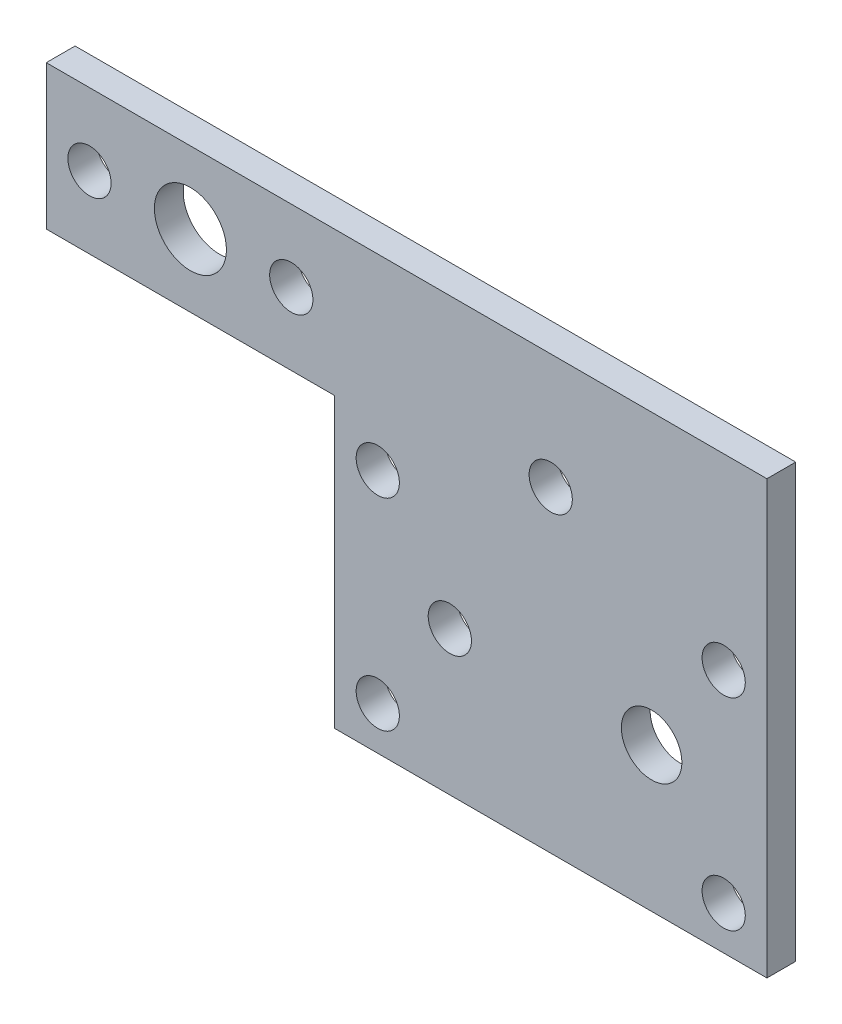
ISO-10303-21;
HEADER;
FILE_DESCRIPTION(('STEP AP214'),'2;1');
FILE_NAME('part.step','',(''),(''),'','','');
FILE_SCHEMA(('AUTOMOTIVE_DESIGN { 1 0 10303 214 1 1 1 1 }'));
ENDSEC;
DATA;
#1=APPLICATION_CONTEXT('core data for automotive mechanical design processes');
#2=APPLICATION_PROTOCOL_DEFINITION('international standard','automotive_design',2000,#1);
#3=PRODUCT_CONTEXT('',#1,'mechanical');
#4=PRODUCT('Part','Part','',(#3));
#5=PRODUCT_RELATED_PRODUCT_CATEGORY('part','',(#4));
#6=PRODUCT_DEFINITION_FORMATION('','',#4);
#7=PRODUCT_DEFINITION_CONTEXT('part definition',#1,'design');
#8=PRODUCT_DEFINITION('design','',#6,#7);
#9=PRODUCT_DEFINITION_SHAPE('','',#8);
#10=(LENGTH_UNIT() NAMED_UNIT(*) SI_UNIT(.MILLI.,.METRE.));
#11=(NAMED_UNIT(*) PLANE_ANGLE_UNIT() SI_UNIT($,.RADIAN.));
#12=(NAMED_UNIT(*) SI_UNIT($,.STERADIAN.) SOLID_ANGLE_UNIT());
#13=UNCERTAINTY_MEASURE_WITH_UNIT(LENGTH_MEASURE(1.E-05),#10,'distance_accuracy_value','');
#14=(GEOMETRIC_REPRESENTATION_CONTEXT(3) GLOBAL_UNCERTAINTY_ASSIGNED_CONTEXT((#13)) GLOBAL_UNIT_ASSIGNED_CONTEXT((#10,
#11,#12)) REPRESENTATION_CONTEXT('',''));
#15=CARTESIAN_POINT('',(0.,0.,0.));
#16=DIRECTION('',(0.,0.,1.));
#17=DIRECTION('',(1.,0.,0.));
#18=AXIS2_PLACEMENT_3D('',#15,#16,#17);
#19=CARTESIAN_POINT('',(0.,0.,2.));
#20=DIRECTION('',(0.,0.,-1.));
#21=DIRECTION('',(-1.,0.,0.));
#22=AXIS2_PLACEMENT_3D('',#19,#20,#21);
#23=PLANE('',#22);
#24=CARTESIAN_POINT('',(42.,10.,2.));
#25=DIRECTION('',(0.,0.,1.));
#26=DIRECTION('',(1.,0.,0.));
#27=AXIS2_PLACEMENT_3D('',#24,#25,#26);
#28=CIRCLE('',#27,2.1);
#29=CARTESIAN_POINT('',(44.1,10.,2.));
#30=VERTEX_POINT('',#29);
#31=EDGE_CURVE('E226',#30,#30,#28,.T.);
#32=ORIENTED_EDGE('',*,*,#31,.F.);
#33=EDGE_LOOP('',(#32));
#34=FACE_BOUND('',#33,.T.);
#35=CARTESIAN_POINT('',(28.,10.,2.));
#36=DIRECTION('',(0.,0.,1.));
#37=DIRECTION('',(1.,0.,0.));
#38=AXIS2_PLACEMENT_3D('',#35,#36,#37);
#39=CIRCLE('',#38,1.5);
#40=CARTESIAN_POINT('',(29.5,10.,2.));
#41=VERTEX_POINT('',#40);
#42=EDGE_CURVE('E238',#41,#41,#39,.T.);
#43=ORIENTED_EDGE('',*,*,#42,.F.);
#44=EDGE_LOOP('',(#43));
#45=FACE_BOUND('',#44,.T.);
#46=CARTESIAN_POINT('',(3.,25.,2.));
#47=DIRECTION('',(0.,0.,1.));
#48=DIRECTION('',(1.,0.,0.));
#49=AXIS2_PLACEMENT_3D('',#46,#47,#48);
#50=CIRCLE('',#49,1.5);
#51=CARTESIAN_POINT('',(4.5,25.,2.));
#52=VERTEX_POINT('',#51);
#53=EDGE_CURVE('E250',#52,#52,#50,.T.);
#54=ORIENTED_EDGE('',*,*,#53,.F.);
#55=EDGE_LOOP('',(#54));
#56=FACE_BOUND('',#55,.T.);
#57=CARTESIAN_POINT('',(47.,3.,2.));
#58=DIRECTION('',(0.,0.,1.));
#59=DIRECTION('',(1.,0.,0.));
#60=AXIS2_PLACEMENT_3D('',#57,#58,#59);
#61=CIRCLE('',#60,1.5);
#62=CARTESIAN_POINT('',(48.5,3.,2.));
#63=VERTEX_POINT('',#62);
#64=EDGE_CURVE('E262',#63,#63,#61,.T.);
#65=ORIENTED_EDGE('',*,*,#64,.F.);
#66=EDGE_LOOP('',(#65));
#67=FACE_BOUND('',#66,.T.);
#68=CARTESIAN_POINT('',(23.,17.,2.));
#69=DIRECTION('',(0.,0.,1.));
#70=DIRECTION('',(1.,0.,0.));
#71=AXIS2_PLACEMENT_3D('',#68,#69,#70);
#72=CIRCLE('',#71,1.5);
#73=CARTESIAN_POINT('',(24.5,17.,2.));
#74=VERTEX_POINT('',#73);
#75=EDGE_CURVE('E134',#74,#74,#72,.T.);
#76=ORIENTED_EDGE('',*,*,#75,.F.);
#77=EDGE_LOOP('',(#76));
#78=FACE_BOUND('',#77,.T.);
#79=DIRECTION('',(0.,1.,0.));
#80=VECTOR('',#79,1.);
#81=CARTESIAN_POINT('',(50.,0.,2.));
#82=LINE('',#81,#80);
#83=CARTESIAN_POINT('',(50.,0.,2.));
#84=VERTEX_POINT('',#83);
#85=CARTESIAN_POINT('',(50.,30.,2.));
#86=VERTEX_POINT('',#85);
#87=EDGE_CURVE('E141',#84,#86,#82,.T.);
#88=ORIENTED_EDGE('',*,*,#87,.T.);
#89=DIRECTION('',(-1.,0.,0.));
#90=VECTOR('',#89,1.);
#91=CARTESIAN_POINT('',(0.,30.,2.));
#92=LINE('',#91,#90);
#93=CARTESIAN_POINT('',(0.,30.,2.));
#94=VERTEX_POINT('',#93);
#95=EDGE_CURVE('E99',#86,#94,#92,.T.);
#96=ORIENTED_EDGE('',*,*,#95,.T.);
#97=DIRECTION('',(0.,-1.,0.));
#98=VECTOR('',#97,1.);
#99=CARTESIAN_POINT('',(0.,20.,2.));
#100=LINE('',#99,#98);
#101=CARTESIAN_POINT('',(0.,20.,2.));
#102=VERTEX_POINT('',#101);
#103=EDGE_CURVE('E112',#94,#102,#100,.T.);
#104=ORIENTED_EDGE('',*,*,#103,.T.);
#105=DIRECTION('',(1.,0.,0.));
#106=VECTOR('',#105,1.);
#107=CARTESIAN_POINT('',(0.,20.,2.));
#108=LINE('',#107,#106);
#109=CARTESIAN_POINT('',(20.,20.,2.));
#110=VERTEX_POINT('',#109);
#111=EDGE_CURVE('E106',#102,#110,#108,.T.);
#112=ORIENTED_EDGE('',*,*,#111,.T.);
#113=DIRECTION('',(0.,-1.,0.));
#114=VECTOR('',#113,1.);
#115=CARTESIAN_POINT('',(20.,0.,2.));
#116=LINE('',#115,#114);
#117=CARTESIAN_POINT('',(20.,0.,2.));
#118=VERTEX_POINT('',#117);
#119=EDGE_CURVE('E110',#110,#118,#116,.T.);
#120=ORIENTED_EDGE('',*,*,#119,.T.);
#121=DIRECTION('',(1.,0.,0.));
#122=VECTOR('',#121,1.);
#123=CARTESIAN_POINT('',(20.,0.,2.));
#124=LINE('',#123,#122);
#125=EDGE_CURVE('E62',#118,#84,#124,.T.);
#126=ORIENTED_EDGE('',*,*,#125,.T.);
#127=EDGE_LOOP('',(#88,#96,#104,#112,#120,#126));
#128=FACE_BOUND('',#127,.T.);
#129=CARTESIAN_POINT('',(23.,3.,2.));
#130=DIRECTION('',(0.,0.,1.));
#131=DIRECTION('',(1.,0.,0.));
#132=AXIS2_PLACEMENT_3D('',#129,#130,#131);
#133=CIRCLE('',#132,1.5);
#134=CARTESIAN_POINT('',(24.5,3.,2.));
#135=VERTEX_POINT('',#134);
#136=EDGE_CURVE('E268',#135,#135,#133,.T.);
#137=ORIENTED_EDGE('',*,*,#136,.F.);
#138=EDGE_LOOP('',(#137));
#139=FACE_BOUND('',#138,.T.);
#140=CARTESIAN_POINT('',(47.,17.,2.));
#141=DIRECTION('',(0.,0.,1.));
#142=DIRECTION('',(1.,0.,0.));
#143=AXIS2_PLACEMENT_3D('',#140,#141,#142);
#144=CIRCLE('',#143,1.5);
#145=CARTESIAN_POINT('',(48.5,17.,2.));
#146=VERTEX_POINT('',#145);
#147=EDGE_CURVE('E256',#146,#146,#144,.T.);
#148=ORIENTED_EDGE('',*,*,#147,.F.);
#149=EDGE_LOOP('',(#148));
#150=FACE_BOUND('',#149,.T.);
#151=CARTESIAN_POINT('',(17.,25.,2.));
#152=DIRECTION('',(0.,0.,1.));
#153=DIRECTION('',(1.,0.,0.));
#154=AXIS2_PLACEMENT_3D('',#151,#152,#153);
#155=CIRCLE('',#154,1.5);
#156=CARTESIAN_POINT('',(18.5,25.,2.));
#157=VERTEX_POINT('',#156);
#158=EDGE_CURVE('E244',#157,#157,#155,.T.);
#159=ORIENTED_EDGE('',*,*,#158,.F.);
#160=EDGE_LOOP('',(#159));
#161=FACE_BOUND('',#160,.T.);
#162=CARTESIAN_POINT('',(35.,22.,2.));
#163=DIRECTION('',(0.,0.,1.));
#164=DIRECTION('',(1.,0.,0.));
#165=AXIS2_PLACEMENT_3D('',#162,#163,#164);
#166=CIRCLE('',#165,1.5);
#167=CARTESIAN_POINT('',(36.5,22.,2.));
#168=VERTEX_POINT('',#167);
#169=EDGE_CURVE('E232',#168,#168,#166,.T.);
#170=ORIENTED_EDGE('',*,*,#169,.F.);
#171=EDGE_LOOP('',(#170));
#172=FACE_BOUND('',#171,.T.);
#173=CARTESIAN_POINT('',(10.,25.,2.));
#174=DIRECTION('',(0.,0.,1.));
#175=DIRECTION('',(1.,0.,0.));
#176=AXIS2_PLACEMENT_3D('',#173,#174,#175);
#177=CIRCLE('',#176,2.5);
#178=CARTESIAN_POINT('',(12.5,25.,2.));
#179=VERTEX_POINT('',#178);
#180=EDGE_CURVE('E217',#179,#179,#177,.T.);
#181=ORIENTED_EDGE('',*,*,#180,.F.);
#182=EDGE_LOOP('',(#181));
#183=FACE_BOUND('',#182,.T.);
#184=ADVANCED_FACE('F45',(#34,#45,#56,#67,#78,#128,#139,#150,#161,#172,#183),#23,.F.);
#185=CARTESIAN_POINT('',(0.,0.,0.));
#186=DIRECTION('',(0.,0.,-1.));
#187=DIRECTION('',(-1.,0.,0.));
#188=AXIS2_PLACEMENT_3D('',#185,#186,#187);
#189=PLANE('',#188);
#190=CARTESIAN_POINT('',(42.,10.,0.));
#191=DIRECTION('',(0.,0.,1.));
#192=DIRECTION('',(1.,0.,0.));
#193=AXIS2_PLACEMENT_3D('',#190,#191,#192);
#194=CIRCLE('',#193,2.1);
#195=CARTESIAN_POINT('',(44.1,10.,0.));
#196=VERTEX_POINT('',#195);
#197=EDGE_CURVE('E223',#196,#196,#194,.T.);
#198=ORIENTED_EDGE('',*,*,#197,.T.);
#199=EDGE_LOOP('',(#198));
#200=FACE_BOUND('',#199,.T.);
#201=CARTESIAN_POINT('',(28.,10.,0.));
#202=DIRECTION('',(0.,0.,1.));
#203=DIRECTION('',(1.,0.,0.));
#204=AXIS2_PLACEMENT_3D('',#201,#202,#203);
#205=CIRCLE('',#204,1.5);
#206=CARTESIAN_POINT('',(29.5,10.,0.));
#207=VERTEX_POINT('',#206);
#208=EDGE_CURVE('E235',#207,#207,#205,.T.);
#209=ORIENTED_EDGE('',*,*,#208,.T.);
#210=EDGE_LOOP('',(#209));
#211=FACE_BOUND('',#210,.T.);
#212=CARTESIAN_POINT('',(3.,25.,0.));
#213=DIRECTION('',(0.,0.,1.));
#214=DIRECTION('',(1.,0.,0.));
#215=AXIS2_PLACEMENT_3D('',#212,#213,#214);
#216=CIRCLE('',#215,1.5);
#217=CARTESIAN_POINT('',(4.5,25.,0.));
#218=VERTEX_POINT('',#217);
#219=EDGE_CURVE('E247',#218,#218,#216,.T.);
#220=ORIENTED_EDGE('',*,*,#219,.T.);
#221=EDGE_LOOP('',(#220));
#222=FACE_BOUND('',#221,.T.);
#223=CARTESIAN_POINT('',(47.,3.,0.));
#224=DIRECTION('',(0.,0.,1.));
#225=DIRECTION('',(1.,0.,0.));
#226=AXIS2_PLACEMENT_3D('',#223,#224,#225);
#227=CIRCLE('',#226,1.5);
#228=CARTESIAN_POINT('',(48.5,3.,0.));
#229=VERTEX_POINT('',#228);
#230=EDGE_CURVE('E259',#229,#229,#227,.T.);
#231=ORIENTED_EDGE('',*,*,#230,.T.);
#232=EDGE_LOOP('',(#231));
#233=FACE_BOUND('',#232,.T.);
#234=CARTESIAN_POINT('',(23.,17.,0.));
#235=DIRECTION('',(0.,0.,1.));
#236=DIRECTION('',(1.,0.,0.));
#237=AXIS2_PLACEMENT_3D('',#234,#235,#236);
#238=CIRCLE('',#237,1.5);
#239=CARTESIAN_POINT('',(24.5,17.,0.));
#240=VERTEX_POINT('',#239);
#241=EDGE_CURVE('E271',#240,#240,#238,.T.);
#242=ORIENTED_EDGE('',*,*,#241,.T.);
#243=EDGE_LOOP('',(#242));
#244=FACE_BOUND('',#243,.T.);
#245=DIRECTION('',(0.,1.,0.));
#246=VECTOR('',#245,1.);
#247=CARTESIAN_POINT('',(50.,0.,0.));
#248=LINE('',#247,#246);
#249=CARTESIAN_POINT('',(50.,0.,0.));
#250=VERTEX_POINT('',#249);
#251=CARTESIAN_POINT('',(50.,30.,0.));
#252=VERTEX_POINT('',#251);
#253=EDGE_CURVE('E130',#250,#252,#248,.T.);
#254=ORIENTED_EDGE('',*,*,#253,.F.);
#255=DIRECTION('',(1.,0.,0.));
#256=VECTOR('',#255,1.);
#257=CARTESIAN_POINT('',(20.,0.,0.));
#258=LINE('',#257,#256);
#259=CARTESIAN_POINT('',(20.,0.,0.));
#260=VERTEX_POINT('',#259);
#261=EDGE_CURVE('E91',#260,#250,#258,.T.);
#262=ORIENTED_EDGE('',*,*,#261,.F.);
#263=DIRECTION('',(0.,-1.,0.));
#264=VECTOR('',#263,1.);
#265=CARTESIAN_POINT('',(20.,0.,0.));
#266=LINE('',#265,#264);
#267=CARTESIAN_POINT('',(20.,20.,0.));
#268=VERTEX_POINT('',#267);
#269=EDGE_CURVE('E85',#268,#260,#266,.T.);
#270=ORIENTED_EDGE('',*,*,#269,.F.);
#271=DIRECTION('',(1.,0.,0.));
#272=VECTOR('',#271,1.);
#273=CARTESIAN_POINT('',(0.,20.,0.));
#274=LINE('',#273,#272);
#275=CARTESIAN_POINT('',(0.,20.,0.));
#276=VERTEX_POINT('',#275);
#277=EDGE_CURVE('E120',#276,#268,#274,.T.);
#278=ORIENTED_EDGE('',*,*,#277,.F.);
#279=DIRECTION('',(0.,-1.,0.));
#280=VECTOR('',#279,1.);
#281=CARTESIAN_POINT('',(0.,20.,0.));
#282=LINE('',#281,#280);
#283=CARTESIAN_POINT('',(0.,30.,0.));
#284=VERTEX_POINT('',#283);
#285=EDGE_CURVE('E136',#284,#276,#282,.T.);
#286=ORIENTED_EDGE('',*,*,#285,.F.);
#287=DIRECTION('',(-1.,0.,0.));
#288=VECTOR('',#287,1.);
#289=CARTESIAN_POINT('',(0.,30.,0.));
#290=LINE('',#289,#288);
#291=EDGE_CURVE('E133',#252,#284,#290,.T.);
#292=ORIENTED_EDGE('',*,*,#291,.F.);
#293=EDGE_LOOP('',(#254,#262,#270,#278,#286,#292));
#294=FACE_BOUND('',#293,.T.);
#295=CARTESIAN_POINT('',(23.,3.,0.));
#296=DIRECTION('',(0.,0.,1.));
#297=DIRECTION('',(1.,0.,0.));
#298=AXIS2_PLACEMENT_3D('',#295,#296,#297);
#299=CIRCLE('',#298,1.5);
#300=CARTESIAN_POINT('',(24.5,3.,0.));
#301=VERTEX_POINT('',#300);
#302=EDGE_CURVE('E265',#301,#301,#299,.T.);
#303=ORIENTED_EDGE('',*,*,#302,.T.);
#304=EDGE_LOOP('',(#303));
#305=FACE_BOUND('',#304,.T.);
#306=CARTESIAN_POINT('',(47.,17.,0.));
#307=DIRECTION('',(0.,0.,1.));
#308=DIRECTION('',(1.,0.,0.));
#309=AXIS2_PLACEMENT_3D('',#306,#307,#308);
#310=CIRCLE('',#309,1.5);
#311=CARTESIAN_POINT('',(48.5,17.,0.));
#312=VERTEX_POINT('',#311);
#313=EDGE_CURVE('E253',#312,#312,#310,.T.);
#314=ORIENTED_EDGE('',*,*,#313,.T.);
#315=EDGE_LOOP('',(#314));
#316=FACE_BOUND('',#315,.T.);
#317=CARTESIAN_POINT('',(17.,25.,0.));
#318=DIRECTION('',(0.,0.,1.));
#319=DIRECTION('',(1.,0.,0.));
#320=AXIS2_PLACEMENT_3D('',#317,#318,#319);
#321=CIRCLE('',#320,1.5);
#322=CARTESIAN_POINT('',(18.5,25.,0.));
#323=VERTEX_POINT('',#322);
#324=EDGE_CURVE('E241',#323,#323,#321,.T.);
#325=ORIENTED_EDGE('',*,*,#324,.T.);
#326=EDGE_LOOP('',(#325));
#327=FACE_BOUND('',#326,.T.);
#328=CARTESIAN_POINT('',(35.,22.,0.));
#329=DIRECTION('',(0.,0.,1.));
#330=DIRECTION('',(1.,0.,0.));
#331=AXIS2_PLACEMENT_3D('',#328,#329,#330);
#332=CIRCLE('',#331,1.5);
#333=CARTESIAN_POINT('',(36.5,22.,0.));
#334=VERTEX_POINT('',#333);
#335=EDGE_CURVE('E229',#334,#334,#332,.T.);
#336=ORIENTED_EDGE('',*,*,#335,.T.);
#337=EDGE_LOOP('',(#336));
#338=FACE_BOUND('',#337,.T.);
#339=CARTESIAN_POINT('',(10.,25.,0.));
#340=DIRECTION('',(0.,0.,1.));
#341=DIRECTION('',(1.,0.,0.));
#342=AXIS2_PLACEMENT_3D('',#339,#340,#341);
#343=CIRCLE('',#342,2.5);
#344=CARTESIAN_POINT('',(12.5,25.,0.));
#345=VERTEX_POINT('',#344);
#346=EDGE_CURVE('E220',#345,#345,#343,.T.);
#347=ORIENTED_EDGE('',*,*,#346,.T.);
#348=EDGE_LOOP('',(#347));
#349=FACE_BOUND('',#348,.T.);
#350=ADVANCED_FACE('F150',(#200,#211,#222,#233,#244,#294,#305,#316,#327,#338,#349),#189,.T.);
#351=CARTESIAN_POINT('',(50.,0.,2.));
#352=DIRECTION('',(-1.,0.,0.));
#353=DIRECTION('',(0.,0.,1.));
#354=AXIS2_PLACEMENT_3D('',#351,#352,#353);
#355=PLANE('',#354);
#356=ORIENTED_EDGE('',*,*,#253,.T.);
#357=DIRECTION('',(0.,0.,-1.));
#358=VECTOR('',#357,1.);
#359=CARTESIAN_POINT('',(50.,30.,2.));
#360=LINE('',#359,#358);
#361=EDGE_CURVE('E13',#86,#252,#360,.T.);
#362=ORIENTED_EDGE('',*,*,#361,.F.);
#363=ORIENTED_EDGE('',*,*,#87,.F.);
#364=DIRECTION('',(0.,0.,-1.));
#365=VECTOR('',#364,1.);
#366=CARTESIAN_POINT('',(50.,0.,2.));
#367=LINE('',#366,#365);
#368=EDGE_CURVE('E126',#84,#250,#367,.T.);
#369=ORIENTED_EDGE('',*,*,#368,.T.);
#370=EDGE_LOOP('',(#356,#362,#363,#369));
#371=FACE_BOUND('',#370,.T.);
#372=ADVANCED_FACE('F47',(#371),#355,.F.);
#373=CARTESIAN_POINT('',(0.,30.,2.));
#374=DIRECTION('',(0.,-1.,0.));
#375=DIRECTION('',(0.,0.,-1.));
#376=AXIS2_PLACEMENT_3D('',#373,#374,#375);
#377=PLANE('',#376);
#378=ORIENTED_EDGE('',*,*,#291,.T.);
#379=DIRECTION('',(0.,0.,-1.));
#380=VECTOR('',#379,1.);
#381=CARTESIAN_POINT('',(0.,30.,2.));
#382=LINE('',#381,#380);
#383=EDGE_CURVE('E54',#94,#284,#382,.T.);
#384=ORIENTED_EDGE('',*,*,#383,.F.);
#385=ORIENTED_EDGE('',*,*,#95,.F.);
#386=ORIENTED_EDGE('',*,*,#361,.T.);
#387=EDGE_LOOP('',(#378,#384,#385,#386));
#388=FACE_BOUND('',#387,.T.);
#389=ADVANCED_FACE('F382',(#388),#377,.F.);
#390=CARTESIAN_POINT('',(0.,20.,2.));
#391=DIRECTION('',(1.,0.,0.));
#392=DIRECTION('',(0.,0.,-1.));
#393=AXIS2_PLACEMENT_3D('',#390,#391,#392);
#394=PLANE('',#393);
#395=ORIENTED_EDGE('',*,*,#285,.T.);
#396=DIRECTION('',(0.,0.,-1.));
#397=VECTOR('',#396,1.);
#398=CARTESIAN_POINT('',(0.,20.,2.));
#399=LINE('',#398,#397);
#400=EDGE_CURVE('E121',#102,#276,#399,.T.);
#401=ORIENTED_EDGE('',*,*,#400,.F.);
#402=ORIENTED_EDGE('',*,*,#103,.F.);
#403=ORIENTED_EDGE('',*,*,#383,.T.);
#404=EDGE_LOOP('',(#395,#401,#402,#403));
#405=FACE_BOUND('',#404,.T.);
#406=ADVANCED_FACE('F147',(#405),#394,.F.);
#407=CARTESIAN_POINT('',(0.,20.,2.));
#408=DIRECTION('',(0.,1.,0.));
#409=DIRECTION('',(0.,0.,1.));
#410=AXIS2_PLACEMENT_3D('',#407,#408,#409);
#411=PLANE('',#410);
#412=ORIENTED_EDGE('',*,*,#277,.T.);
#413=DIRECTION('',(0.,0.,-1.));
#414=VECTOR('',#413,1.);
#415=CARTESIAN_POINT('',(20.,20.,2.));
#416=LINE('',#415,#414);
#417=EDGE_CURVE('E117',#110,#268,#416,.T.);
#418=ORIENTED_EDGE('',*,*,#417,.F.);
#419=ORIENTED_EDGE('',*,*,#111,.F.);
#420=ORIENTED_EDGE('',*,*,#400,.T.);
#421=EDGE_LOOP('',(#412,#418,#419,#420));
#422=FACE_BOUND('',#421,.T.);
#423=ADVANCED_FACE('F118',(#422),#411,.F.);
#424=CARTESIAN_POINT('',(20.,0.,2.));
#425=DIRECTION('',(1.,0.,0.));
#426=DIRECTION('',(0.,0.,-1.));
#427=AXIS2_PLACEMENT_3D('',#424,#425,#426);
#428=PLANE('',#427);
#429=ORIENTED_EDGE('',*,*,#269,.T.);
#430=DIRECTION('',(0.,0.,-1.));
#431=VECTOR('',#430,1.);
#432=CARTESIAN_POINT('',(20.,0.,2.));
#433=LINE('',#432,#431);
#434=EDGE_CURVE('E122',#118,#260,#433,.T.);
#435=ORIENTED_EDGE('',*,*,#434,.F.);
#436=ORIENTED_EDGE('',*,*,#119,.F.);
#437=ORIENTED_EDGE('',*,*,#417,.T.);
#438=EDGE_LOOP('',(#429,#435,#436,#437));
#439=FACE_BOUND('',#438,.T.);
#440=ADVANCED_FACE('F124',(#439),#428,.F.);
#441=CARTESIAN_POINT('',(20.,0.,2.));
#442=DIRECTION('',(0.,1.,0.));
#443=DIRECTION('',(0.,0.,1.));
#444=AXIS2_PLACEMENT_3D('',#441,#442,#443);
#445=PLANE('',#444);
#446=ORIENTED_EDGE('',*,*,#261,.T.);
#447=ORIENTED_EDGE('',*,*,#368,.F.);
#448=ORIENTED_EDGE('',*,*,#125,.F.);
#449=ORIENTED_EDGE('',*,*,#434,.T.);
#450=EDGE_LOOP('',(#446,#447,#448,#449));
#451=FACE_BOUND('',#450,.T.);
#452=ADVANCED_FACE('F155',(#451),#445,.F.);
#453=CARTESIAN_POINT('',(23.,17.,2.));
#454=DIRECTION('',(0.,0.,-1.));
#455=DIRECTION('',(-1.,0.,0.));
#456=AXIS2_PLACEMENT_3D('',#453,#454,#455);
#457=CYLINDRICAL_SURFACE('',#456,1.5);
#458=ORIENTED_EDGE('',*,*,#75,.T.);
#459=EDGE_LOOP('',(#458));
#460=FACE_BOUND('',#459,.T.);
#461=ORIENTED_EDGE('',*,*,#241,.F.);
#462=EDGE_LOOP('',(#461));
#463=FACE_BOUND('',#462,.T.);
#464=ADVANCED_FACE('F157',(#460,#463),#457,.F.);
#465=CARTESIAN_POINT('',(23.,3.,2.));
#466=DIRECTION('',(0.,0.,-1.));
#467=DIRECTION('',(-1.,0.,0.));
#468=AXIS2_PLACEMENT_3D('',#465,#466,#467);
#469=CYLINDRICAL_SURFACE('',#468,1.5);
#470=ORIENTED_EDGE('',*,*,#136,.T.);
#471=EDGE_LOOP('',(#470));
#472=FACE_BOUND('',#471,.T.);
#473=ORIENTED_EDGE('',*,*,#302,.F.);
#474=EDGE_LOOP('',(#473));
#475=FACE_BOUND('',#474,.T.);
#476=ADVANCED_FACE('F163',(#472,#475),#469,.F.);
#477=CARTESIAN_POINT('',(47.,3.,2.));
#478=DIRECTION('',(0.,0.,-1.));
#479=DIRECTION('',(-1.,0.,0.));
#480=AXIS2_PLACEMENT_3D('',#477,#478,#479);
#481=CYLINDRICAL_SURFACE('',#480,1.5);
#482=ORIENTED_EDGE('',*,*,#64,.T.);
#483=EDGE_LOOP('',(#482));
#484=FACE_BOUND('',#483,.T.);
#485=ORIENTED_EDGE('',*,*,#230,.F.);
#486=EDGE_LOOP('',(#485));
#487=FACE_BOUND('',#486,.T.);
#488=ADVANCED_FACE('F180',(#484,#487),#481,.F.);
#489=CARTESIAN_POINT('',(47.,17.,2.));
#490=DIRECTION('',(0.,0.,-1.));
#491=DIRECTION('',(-1.,0.,0.));
#492=AXIS2_PLACEMENT_3D('',#489,#490,#491);
#493=CYLINDRICAL_SURFACE('',#492,1.5);
#494=ORIENTED_EDGE('',*,*,#147,.T.);
#495=EDGE_LOOP('',(#494));
#496=FACE_BOUND('',#495,.T.);
#497=ORIENTED_EDGE('',*,*,#313,.F.);
#498=EDGE_LOOP('',(#497));
#499=FACE_BOUND('',#498,.T.);
#500=ADVANCED_FACE('F184',(#496,#499),#493,.F.);
#501=CARTESIAN_POINT('',(3.,25.,2.));
#502=DIRECTION('',(0.,0.,-1.));
#503=DIRECTION('',(-1.,0.,0.));
#504=AXIS2_PLACEMENT_3D('',#501,#502,#503);
#505=CYLINDRICAL_SURFACE('',#504,1.5);
#506=ORIENTED_EDGE('',*,*,#53,.T.);
#507=EDGE_LOOP('',(#506));
#508=FACE_BOUND('',#507,.T.);
#509=ORIENTED_EDGE('',*,*,#219,.F.);
#510=EDGE_LOOP('',(#509));
#511=FACE_BOUND('',#510,.T.);
#512=ADVANCED_FACE('F188',(#508,#511),#505,.F.);
#513=CARTESIAN_POINT('',(17.,25.,2.));
#514=DIRECTION('',(0.,0.,-1.));
#515=DIRECTION('',(-1.,0.,0.));
#516=AXIS2_PLACEMENT_3D('',#513,#514,#515);
#517=CYLINDRICAL_SURFACE('',#516,1.5);
#518=ORIENTED_EDGE('',*,*,#158,.T.);
#519=EDGE_LOOP('',(#518));
#520=FACE_BOUND('',#519,.T.);
#521=ORIENTED_EDGE('',*,*,#324,.F.);
#522=EDGE_LOOP('',(#521));
#523=FACE_BOUND('',#522,.T.);
#524=ADVANCED_FACE('F192',(#520,#523),#517,.F.);
#525=CARTESIAN_POINT('',(28.,10.,2.));
#526=DIRECTION('',(0.,0.,-1.));
#527=DIRECTION('',(-1.,0.,0.));
#528=AXIS2_PLACEMENT_3D('',#525,#526,#527);
#529=CYLINDRICAL_SURFACE('',#528,1.5);
#530=ORIENTED_EDGE('',*,*,#42,.T.);
#531=EDGE_LOOP('',(#530));
#532=FACE_BOUND('',#531,.T.);
#533=ORIENTED_EDGE('',*,*,#208,.F.);
#534=EDGE_LOOP('',(#533));
#535=FACE_BOUND('',#534,.T.);
#536=ADVANCED_FACE('F196',(#532,#535),#529,.F.);
#537=CARTESIAN_POINT('',(35.,22.,2.));
#538=DIRECTION('',(0.,0.,-1.));
#539=DIRECTION('',(-1.,0.,0.));
#540=AXIS2_PLACEMENT_3D('',#537,#538,#539);
#541=CYLINDRICAL_SURFACE('',#540,1.5);
#542=ORIENTED_EDGE('',*,*,#169,.T.);
#543=EDGE_LOOP('',(#542));
#544=FACE_BOUND('',#543,.T.);
#545=ORIENTED_EDGE('',*,*,#335,.F.);
#546=EDGE_LOOP('',(#545));
#547=FACE_BOUND('',#546,.T.);
#548=ADVANCED_FACE('F200',(#544,#547),#541,.F.);
#549=CARTESIAN_POINT('',(42.,10.,2.));
#550=DIRECTION('',(0.,0.,-1.));
#551=DIRECTION('',(-1.,0.,0.));
#552=AXIS2_PLACEMENT_3D('',#549,#550,#551);
#553=CYLINDRICAL_SURFACE('',#552,2.1);
#554=ORIENTED_EDGE('',*,*,#31,.T.);
#555=EDGE_LOOP('',(#554));
#556=FACE_BOUND('',#555,.T.);
#557=ORIENTED_EDGE('',*,*,#197,.F.);
#558=EDGE_LOOP('',(#557));
#559=FACE_BOUND('',#558,.T.);
#560=ADVANCED_FACE('F204',(#556,#559),#553,.F.);
#561=CARTESIAN_POINT('',(10.,25.,2.));
#562=DIRECTION('',(0.,0.,-1.));
#563=DIRECTION('',(-1.,0.,0.));
#564=AXIS2_PLACEMENT_3D('',#561,#562,#563);
#565=CYLINDRICAL_SURFACE('',#564,2.5);
#566=ORIENTED_EDGE('',*,*,#180,.T.);
#567=EDGE_LOOP('',(#566));
#568=FACE_BOUND('',#567,.T.);
#569=ORIENTED_EDGE('',*,*,#346,.F.);
#570=EDGE_LOOP('',(#569));
#571=FACE_BOUND('',#570,.T.);
#572=ADVANCED_FACE('F208',(#568,#571),#565,.F.);
#573=CLOSED_SHELL('',(#184,#350,#372,#389,#406,#423,#440,#452,#464,#476,#488,#500,#512,#524,
#536,#548,#560,#572));
#574=MANIFOLD_SOLID_BREP('B2',#573);
#575=ADVANCED_BREP_SHAPE_REPRESENTATION('',(#18,#574),#14);
#576=SHAPE_DEFINITION_REPRESENTATION(#9,#575);
ENDSEC;
END-ISO-10303-21;
